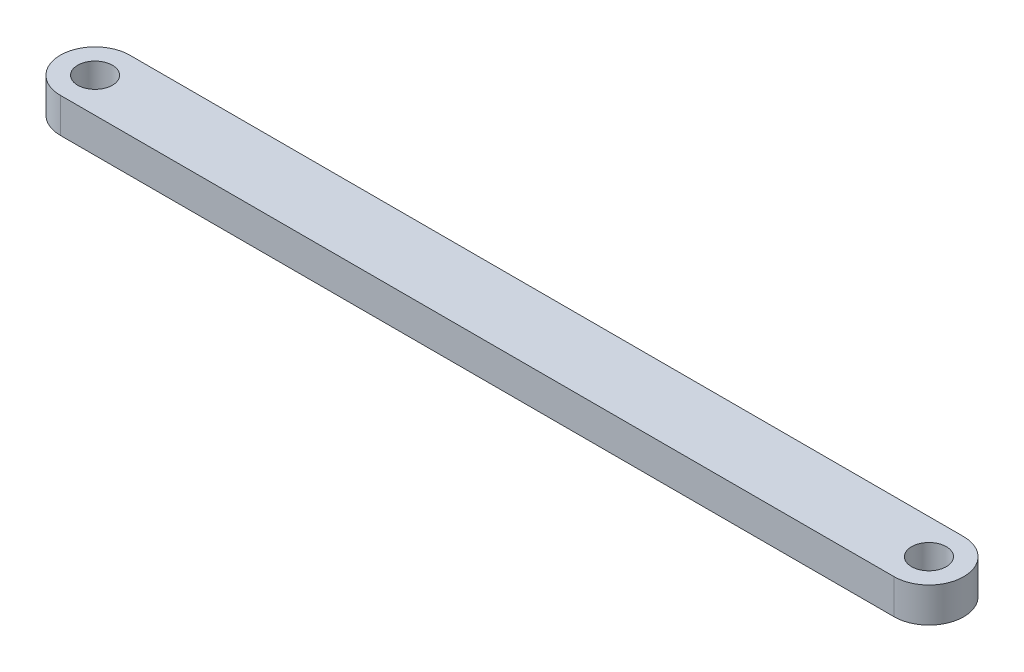
ISO-10303-21;
HEADER;
FILE_DESCRIPTION(('STEP AP214'),'2;1');
FILE_NAME('part.step','',(''),(''),'','','');
FILE_SCHEMA(('AUTOMOTIVE_DESIGN { 1 0 10303 214 1 1 1 1 }'));
ENDSEC;
DATA;
#1=APPLICATION_CONTEXT('core data for automotive mechanical design processes');
#2=APPLICATION_PROTOCOL_DEFINITION('international standard','automotive_design',2000,#1);
#3=PRODUCT_CONTEXT('',#1,'mechanical');
#4=PRODUCT('Part','Part','',(#3));
#5=PRODUCT_RELATED_PRODUCT_CATEGORY('part','',(#4));
#6=PRODUCT_DEFINITION_FORMATION('','',#4);
#7=PRODUCT_DEFINITION_CONTEXT('part definition',#1,'design');
#8=PRODUCT_DEFINITION('design','',#6,#7);
#9=PRODUCT_DEFINITION_SHAPE('','',#8);
#10=(LENGTH_UNIT() NAMED_UNIT(*) SI_UNIT(.MILLI.,.METRE.));
#11=(NAMED_UNIT(*) PLANE_ANGLE_UNIT() SI_UNIT($,.RADIAN.));
#12=(NAMED_UNIT(*) SI_UNIT($,.STERADIAN.) SOLID_ANGLE_UNIT());
#13=UNCERTAINTY_MEASURE_WITH_UNIT(LENGTH_MEASURE(1.E-05),#10,'distance_accuracy_value','');
#14=(GEOMETRIC_REPRESENTATION_CONTEXT(3) GLOBAL_UNCERTAINTY_ASSIGNED_CONTEXT((#13)) GLOBAL_UNIT_ASSIGNED_CONTEXT((#10,
#11,#12)) REPRESENTATION_CONTEXT('',''));
#15=CARTESIAN_POINT('',(0.,0.,0.));
#16=DIRECTION('',(0.,0.,1.));
#17=DIRECTION('',(1.,0.,0.));
#18=AXIS2_PLACEMENT_3D('',#15,#16,#17);
#19=CARTESIAN_POINT('',(60.,5.,0.));
#20=DIRECTION('',(0.,1.,0.));
#21=DIRECTION('',(0.,0.,1.));
#22=AXIS2_PLACEMENT_3D('',#19,#20,#21);
#23=PLANE('',#22);
#24=CARTESIAN_POINT('',(60.,5.,0.));
#25=DIRECTION('',(0.,1.,0.));
#26=DIRECTION('',(0.,0.,1.));
#27=AXIS2_PLACEMENT_3D('',#24,#25,#26);
#28=CIRCLE('',#27,2.5);
#29=CARTESIAN_POINT('',(60.,5.,2.49999999999998));
#30=VERTEX_POINT('',#29);
#31=EDGE_CURVE('E100',#30,#30,#28,.T.);
#32=ORIENTED_EDGE('',*,*,#31,.F.);
#33=EDGE_LOOP('',(#32));
#34=FACE_BOUND('',#33,.T.);
#35=CARTESIAN_POINT('',(60.,5.,0.));
#36=DIRECTION('',(0.,1.,0.));
#37=DIRECTION('',(0.,0.,1.));
#38=AXIS2_PLACEMENT_3D('',#35,#36,#37);
#39=CIRCLE('',#38,4.99999999999998);
#40=CARTESIAN_POINT('',(60.,5.,4.99999999999995));
#41=VERTEX_POINT('',#40);
#42=CARTESIAN_POINT('',(60.,5.,-5.));
#43=VERTEX_POINT('',#42);
#44=EDGE_CURVE('E85',#41,#43,#39,.T.);
#45=ORIENTED_EDGE('',*,*,#44,.T.);
#46=DIRECTION('',(-1.,0.,0.));
#47=VECTOR('',#46,1.);
#48=CARTESIAN_POINT('',(60.,5.,-5.));
#49=LINE('',#48,#47);
#50=CARTESIAN_POINT('',(-60.,5.,-4.99999999999996));
#51=VERTEX_POINT('',#50);
#52=EDGE_CURVE('E80',#43,#51,#49,.T.);
#53=ORIENTED_EDGE('',*,*,#52,.T.);
#54=CARTESIAN_POINT('',(-60.,5.,0.));
#55=DIRECTION('',(0.,1.,0.));
#56=DIRECTION('',(0.,0.,1.));
#57=AXIS2_PLACEMENT_3D('',#54,#55,#56);
#58=CIRCLE('',#57,4.99999999999998);
#59=CARTESIAN_POINT('',(-60.,5.,4.99999999999999));
#60=VERTEX_POINT('',#59);
#61=EDGE_CURVE('E83',#51,#60,#58,.T.);
#62=ORIENTED_EDGE('',*,*,#61,.T.);
#63=DIRECTION('',(1.,0.,0.));
#64=VECTOR('',#63,1.);
#65=CARTESIAN_POINT('',(60.,5.,4.99999999999995));
#66=LINE('',#65,#64);
#67=EDGE_CURVE('E50',#60,#41,#66,.T.);
#68=ORIENTED_EDGE('',*,*,#67,.T.);
#69=EDGE_LOOP('',(#45,#53,#62,#68));
#70=FACE_BOUND('',#69,.T.);
#71=CARTESIAN_POINT('',(-60.,5.,0.));
#72=DIRECTION('',(0.,1.,0.));
#73=DIRECTION('',(0.,0.,1.));
#74=AXIS2_PLACEMENT_3D('',#71,#72,#73);
#75=CIRCLE('',#74,2.5);
#76=CARTESIAN_POINT('',(-60.,5.,2.50000000000002));
#77=VERTEX_POINT('',#76);
#78=EDGE_CURVE('E115',#77,#77,#75,.T.);
#79=ORIENTED_EDGE('',*,*,#78,.F.);
#80=EDGE_LOOP('',(#79));
#81=FACE_BOUND('',#80,.T.);
#82=ADVANCED_FACE('F33',(#34,#70,#81),#23,.T.);
#83=CARTESIAN_POINT('',(60.,0.,0.));
#84=DIRECTION('',(0.,1.,0.));
#85=DIRECTION('',(0.,0.,1.));
#86=AXIS2_PLACEMENT_3D('',#83,#84,#85);
#87=PLANE('',#86);
#88=CARTESIAN_POINT('',(60.,0.,0.));
#89=DIRECTION('',(0.,1.,0.));
#90=DIRECTION('',(0.,0.,1.));
#91=AXIS2_PLACEMENT_3D('',#88,#89,#90);
#92=CIRCLE('',#91,4.99999999999998);
#93=CARTESIAN_POINT('',(60.,0.,4.99999999999995));
#94=VERTEX_POINT('',#93);
#95=CARTESIAN_POINT('',(60.,0.,-5.));
#96=VERTEX_POINT('',#95);
#97=EDGE_CURVE('E97',#94,#96,#92,.T.);
#98=ORIENTED_EDGE('',*,*,#97,.F.);
#99=DIRECTION('',(1.,0.,0.));
#100=VECTOR('',#99,1.);
#101=CARTESIAN_POINT('',(60.,0.,4.99999999999995));
#102=LINE('',#101,#100);
#103=CARTESIAN_POINT('',(-60.,0.,4.99999999999999));
#104=VERTEX_POINT('',#103);
#105=EDGE_CURVE('E73',#104,#94,#102,.T.);
#106=ORIENTED_EDGE('',*,*,#105,.F.);
#107=CARTESIAN_POINT('',(-60.,0.,0.));
#108=DIRECTION('',(0.,1.,0.));
#109=DIRECTION('',(0.,0.,1.));
#110=AXIS2_PLACEMENT_3D('',#107,#108,#109);
#111=CIRCLE('',#110,4.99999999999998);
#112=CARTESIAN_POINT('',(-60.,0.,-4.99999999999996));
#113=VERTEX_POINT('',#112);
#114=EDGE_CURVE('E67',#113,#104,#111,.T.);
#115=ORIENTED_EDGE('',*,*,#114,.F.);
#116=DIRECTION('',(-1.,0.,0.));
#117=VECTOR('',#116,1.);
#118=CARTESIAN_POINT('',(60.,0.,-5.));
#119=LINE('',#118,#117);
#120=EDGE_CURVE('E89',#96,#113,#119,.T.);
#121=ORIENTED_EDGE('',*,*,#120,.F.);
#122=EDGE_LOOP('',(#98,#106,#115,#121));
#123=FACE_BOUND('',#122,.T.);
#124=CARTESIAN_POINT('',(60.,0.,0.));
#125=DIRECTION('',(0.,1.,0.));
#126=DIRECTION('',(0.,0.,1.));
#127=AXIS2_PLACEMENT_3D('',#124,#125,#126);
#128=CIRCLE('',#127,2.5);
#129=CARTESIAN_POINT('',(60.,0.,2.49999999999998));
#130=VERTEX_POINT('',#129);
#131=EDGE_CURVE('E112',#130,#130,#128,.T.);
#132=ORIENTED_EDGE('',*,*,#131,.T.);
#133=EDGE_LOOP('',(#132));
#134=FACE_BOUND('',#133,.T.);
#135=CARTESIAN_POINT('',(-60.,0.,0.));
#136=DIRECTION('',(0.,1.,0.));
#137=DIRECTION('',(0.,0.,1.));
#138=AXIS2_PLACEMENT_3D('',#135,#136,#137);
#139=CIRCLE('',#138,2.5);
#140=CARTESIAN_POINT('',(-60.,0.,2.50000000000002));
#141=VERTEX_POINT('',#140);
#142=EDGE_CURVE('E118',#141,#141,#139,.T.);
#143=ORIENTED_EDGE('',*,*,#142,.T.);
#144=EDGE_LOOP('',(#143));
#145=FACE_BOUND('',#144,.T.);
#146=ADVANCED_FACE('F108',(#123,#134,#145),#87,.F.);
#147=CARTESIAN_POINT('',(60.,5.,0.));
#148=DIRECTION('',(0.,-1.,0.));
#149=DIRECTION('',(0.,0.,-1.));
#150=AXIS2_PLACEMENT_3D('',#147,#148,#149);
#151=CYLINDRICAL_SURFACE('',#150,4.99999999999998);
#152=ORIENTED_EDGE('',*,*,#97,.T.);
#153=DIRECTION('',(0.,-1.,0.));
#154=VECTOR('',#153,1.);
#155=CARTESIAN_POINT('',(60.,5.,-5.));
#156=LINE('',#155,#154);
#157=EDGE_CURVE('E11',#43,#96,#156,.T.);
#158=ORIENTED_EDGE('',*,*,#157,.F.);
#159=ORIENTED_EDGE('',*,*,#44,.F.);
#160=DIRECTION('',(0.,-1.,0.));
#161=VECTOR('',#160,1.);
#162=CARTESIAN_POINT('',(60.,5.,4.99999999999995));
#163=LINE('',#162,#161);
#164=EDGE_CURVE('E93',#41,#94,#163,.T.);
#165=ORIENTED_EDGE('',*,*,#164,.T.);
#166=EDGE_LOOP('',(#152,#158,#159,#165));
#167=FACE_BOUND('',#166,.T.);
#168=ADVANCED_FACE('F35',(#167),#151,.T.);
#169=CARTESIAN_POINT('',(60.,5.,-5.));
#170=DIRECTION('',(0.,0.,1.));
#171=DIRECTION('',(1.,0.,0.));
#172=AXIS2_PLACEMENT_3D('',#169,#170,#171);
#173=PLANE('',#172);
#174=ORIENTED_EDGE('',*,*,#120,.T.);
#175=DIRECTION('',(0.,-1.,0.));
#176=VECTOR('',#175,1.);
#177=CARTESIAN_POINT('',(-60.,5.,-4.99999999999996));
#178=LINE('',#177,#176);
#179=EDGE_CURVE('E42',#51,#113,#178,.T.);
#180=ORIENTED_EDGE('',*,*,#179,.F.);
#181=ORIENTED_EDGE('',*,*,#52,.F.);
#182=ORIENTED_EDGE('',*,*,#157,.T.);
#183=EDGE_LOOP('',(#174,#180,#181,#182));
#184=FACE_BOUND('',#183,.T.);
#185=ADVANCED_FACE('F88',(#184),#173,.F.);
#186=CARTESIAN_POINT('',(-60.,5.,0.));
#187=DIRECTION('',(0.,-1.,0.));
#188=DIRECTION('',(0.,0.,-1.));
#189=AXIS2_PLACEMENT_3D('',#186,#187,#188);
#190=CYLINDRICAL_SURFACE('',#189,4.99999999999998);
#191=ORIENTED_EDGE('',*,*,#114,.T.);
#192=DIRECTION('',(0.,-1.,0.));
#193=VECTOR('',#192,1.);
#194=CARTESIAN_POINT('',(-60.,5.,4.99999999999999));
#195=LINE('',#194,#193);
#196=EDGE_CURVE('E90',#60,#104,#195,.T.);
#197=ORIENTED_EDGE('',*,*,#196,.F.);
#198=ORIENTED_EDGE('',*,*,#61,.F.);
#199=ORIENTED_EDGE('',*,*,#179,.T.);
#200=EDGE_LOOP('',(#191,#197,#198,#199));
#201=FACE_BOUND('',#200,.T.);
#202=ADVANCED_FACE('F91',(#201),#190,.T.);
#203=CARTESIAN_POINT('',(60.,5.,4.99999999999995));
#204=DIRECTION('',(0.,0.,-1.));
#205=DIRECTION('',(-1.,0.,0.));
#206=AXIS2_PLACEMENT_3D('',#203,#204,#205);
#207=PLANE('',#206);
#208=ORIENTED_EDGE('',*,*,#105,.T.);
#209=ORIENTED_EDGE('',*,*,#164,.F.);
#210=ORIENTED_EDGE('',*,*,#67,.F.);
#211=ORIENTED_EDGE('',*,*,#196,.T.);
#212=EDGE_LOOP('',(#208,#209,#210,#211));
#213=FACE_BOUND('',#212,.T.);
#214=ADVANCED_FACE('F105',(#213),#207,.F.);
#215=CARTESIAN_POINT('',(60.,5.,0.));
#216=DIRECTION('',(0.,-1.,0.));
#217=DIRECTION('',(0.,0.,-1.));
#218=AXIS2_PLACEMENT_3D('',#215,#216,#217);
#219=CYLINDRICAL_SURFACE('',#218,2.5);
#220=ORIENTED_EDGE('',*,*,#31,.T.);
#221=EDGE_LOOP('',(#220));
#222=FACE_BOUND('',#221,.T.);
#223=ORIENTED_EDGE('',*,*,#131,.F.);
#224=EDGE_LOOP('',(#223));
#225=FACE_BOUND('',#224,.T.);
#226=ADVANCED_FACE('F135',(#222,#225),#219,.F.);
#227=CARTESIAN_POINT('',(-60.,5.,0.));
#228=DIRECTION('',(0.,-1.,0.));
#229=DIRECTION('',(0.,0.,-1.));
#230=AXIS2_PLACEMENT_3D('',#227,#228,#229);
#231=CYLINDRICAL_SURFACE('',#230,2.5);
#232=ORIENTED_EDGE('',*,*,#78,.T.);
#233=EDGE_LOOP('',(#232));
#234=FACE_BOUND('',#233,.T.);
#235=ORIENTED_EDGE('',*,*,#142,.F.);
#236=EDGE_LOOP('',(#235));
#237=FACE_BOUND('',#236,.T.);
#238=ADVANCED_FACE('F124',(#234,#237),#231,.F.);
#239=CLOSED_SHELL('',(#82,#146,#168,#185,#202,#214,#226,#238));
#240=MANIFOLD_SOLID_BREP('B2',#239);
#241=ADVANCED_BREP_SHAPE_REPRESENTATION('',(#18,#240),#14);
#242=SHAPE_DEFINITION_REPRESENTATION(#9,#241);
ENDSEC;
END-ISO-10303-21;
